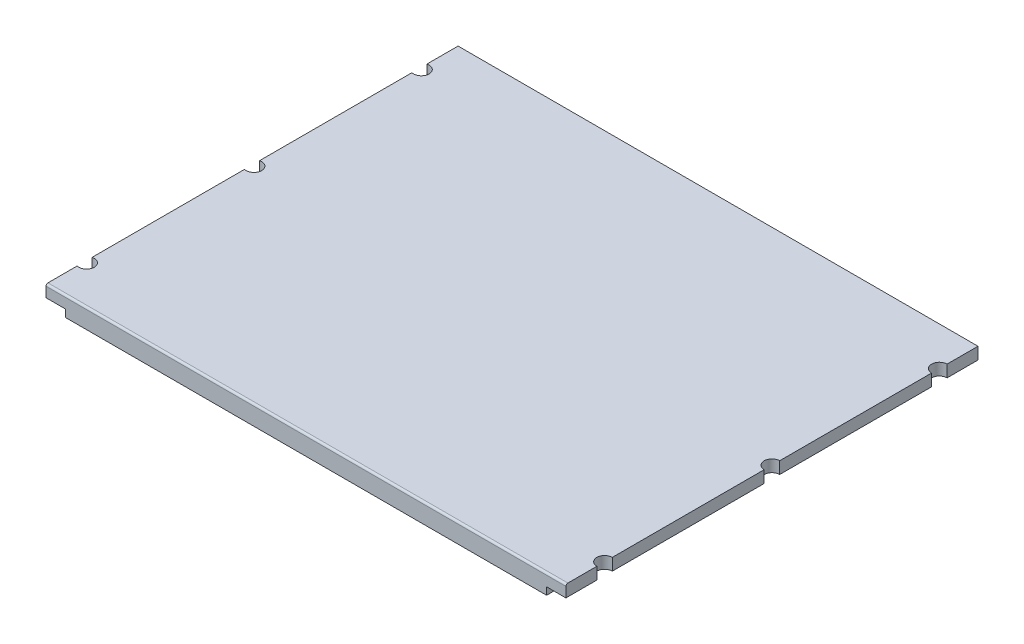
ISO-10303-21;
HEADER;
FILE_DESCRIPTION(('STEP AP214'),'2;1');
FILE_NAME('part.step','',(''),(''),'','','');
FILE_SCHEMA(('AUTOMOTIVE_DESIGN { 1 0 10303 214 1 1 1 1 }'));
ENDSEC;
DATA;
#1=APPLICATION_CONTEXT('core data for automotive mechanical design processes');
#2=APPLICATION_PROTOCOL_DEFINITION('international standard','automotive_design',2000,#1);
#3=PRODUCT_CONTEXT('',#1,'mechanical');
#4=PRODUCT('Part','Part','',(#3));
#5=PRODUCT_RELATED_PRODUCT_CATEGORY('part','',(#4));
#6=PRODUCT_DEFINITION_FORMATION('','',#4);
#7=PRODUCT_DEFINITION_CONTEXT('part definition',#1,'design');
#8=PRODUCT_DEFINITION('design','',#6,#7);
#9=PRODUCT_DEFINITION_SHAPE('','',#8);
#10=(LENGTH_UNIT() NAMED_UNIT(*) SI_UNIT(.MILLI.,.METRE.));
#11=(NAMED_UNIT(*) PLANE_ANGLE_UNIT() SI_UNIT($,.RADIAN.));
#12=(NAMED_UNIT(*) SI_UNIT($,.STERADIAN.) SOLID_ANGLE_UNIT());
#13=UNCERTAINTY_MEASURE_WITH_UNIT(LENGTH_MEASURE(1.E-05),#10,'distance_accuracy_value','');
#14=(GEOMETRIC_REPRESENTATION_CONTEXT(3) GLOBAL_UNCERTAINTY_ASSIGNED_CONTEXT((#13)) GLOBAL_UNIT_ASSIGNED_CONTEXT((#10,
#11,#12)) REPRESENTATION_CONTEXT('',''));
#15=CARTESIAN_POINT('',(0.,0.,0.));
#16=DIRECTION('',(0.,0.,1.));
#17=DIRECTION('',(1.,0.,0.));
#18=AXIS2_PLACEMENT_3D('',#15,#16,#17);
#19=CARTESIAN_POINT('',(35.,216.978424147796,2.99000000000001));
#20=DIRECTION('',(1.,0.,0.));
#21=DIRECTION('',(0.,0.,-1.));
#22=AXIS2_PLACEMENT_3D('',#19,#20,#21);
#23=PLANE('',#22);
#24=DIRECTION('',(0.,0.,1.));
#25=VECTOR('',#24,1.);
#26=CARTESIAN_POINT('',(35.,196.904550768447,2.99000000000001));
#27=LINE('',#26,#25);
#28=CARTESIAN_POINT('',(35.,196.904550768447,14.9364916731037));
#29=VERTEX_POINT('',#28);
#30=CARTESIAN_POINT('',(35.,196.904550768447,54.3635083268964));
#31=VERTEX_POINT('',#30);
#32=EDGE_CURVE('E245',#29,#31,#27,.T.);
#33=ORIENTED_EDGE('',*,*,#32,.T.);
#34=DIRECTION('',(0.,1.,0.));
#35=VECTOR('',#34,1.);
#36=CARTESIAN_POINT('',(35.,190.,54.3635083268964));
#37=LINE('',#36,#35);
#38=CARTESIAN_POINT('',(35.,200.,54.3635083268964));
#39=VERTEX_POINT('',#38);
#40=EDGE_CURVE('E272',#39,#31,#37,.F.);
#41=ORIENTED_EDGE('',*,*,#40,.F.);
#42=DIRECTION('',(0.,0.,1.));
#43=VECTOR('',#42,1.);
#44=CARTESIAN_POINT('',(35.,200.,109.6));
#45=LINE('',#44,#43);
#46=CARTESIAN_POINT('',(35.,200.,14.9364916731037));
#47=VERTEX_POINT('',#46);
#48=EDGE_CURVE('E293',#47,#39,#45,.T.);
#49=ORIENTED_EDGE('',*,*,#48,.F.);
#50=DIRECTION('',(0.,1.,0.));
#51=VECTOR('',#50,1.);
#52=CARTESIAN_POINT('',(35.,190.,14.9364916731037));
#53=LINE('',#52,#51);
#54=EDGE_CURVE('E288',#29,#47,#53,.T.);
#55=ORIENTED_EDGE('',*,*,#54,.F.);
#56=EDGE_LOOP('',(#33,#41,#49,#55));
#57=FACE_BOUND('',#56,.T.);
#58=ADVANCED_FACE('F33',(#57),#23,.F.);
#59=CARTESIAN_POINT('',(35.,200.,58.2364916731036));
#60=VERTEX_POINT('',#59);
#61=CARTESIAN_POINT('',(35.,200.,97.6635083268963));
#62=VERTEX_POINT('',#61);
#63=EDGE_CURVE('E365',#60,#62,#45,.T.);
#64=ORIENTED_EDGE('',*,*,#63,.F.);
#65=DIRECTION('',(0.,1.,0.));
#66=VECTOR('',#65,1.);
#67=CARTESIAN_POINT('',(35.,190.,58.2364916731036));
#68=LINE('',#67,#66);
#69=CARTESIAN_POINT('',(35.,196.904550768447,58.2364916731036));
#70=VERTEX_POINT('',#69);
#71=EDGE_CURVE('E264',#70,#60,#68,.T.);
#72=ORIENTED_EDGE('',*,*,#71,.F.);
#73=CARTESIAN_POINT('',(35.,196.904550768447,97.6635083268963));
#74=VERTEX_POINT('',#73);
#75=EDGE_CURVE('E251',#70,#74,#27,.T.);
#76=ORIENTED_EDGE('',*,*,#75,.T.);
#77=DIRECTION('',(0.,1.,0.));
#78=VECTOR('',#77,1.);
#79=CARTESIAN_POINT('',(35.,190.,97.6635083268963));
#80=LINE('',#79,#78);
#81=EDGE_CURVE('E262',#62,#74,#80,.F.);
#82=ORIENTED_EDGE('',*,*,#81,.F.);
#83=EDGE_LOOP('',(#64,#72,#76,#82));
#84=FACE_BOUND('',#83,.T.);
#85=ADVANCED_FACE('F261',(#84),#23,.F.);
#86=CARTESIAN_POINT('',(40.,196.904550768447,2.99000000000001));
#87=DIRECTION('',(0.,1.,0.));
#88=DIRECTION('',(0.,0.,1.));
#89=AXIS2_PLACEMENT_3D('',#86,#87,#88);
#90=PLANE('',#89);
#91=DIRECTION('',(0.,0.,1.));
#92=VECTOR('',#91,1.);
#93=CARTESIAN_POINT('',(40.,196.904550768447,2.99000000000001));
#94=LINE('',#93,#92);
#95=CARTESIAN_POINT('',(40.,196.904550768447,3.));
#96=VERTEX_POINT('',#95);
#97=CARTESIAN_POINT('',(40.,196.904550768447,109.6));
#98=VERTEX_POINT('',#97);
#99=EDGE_CURVE('E208',#96,#98,#94,.T.);
#100=ORIENTED_EDGE('',*,*,#99,.T.);
#101=DIRECTION('',(1.,0.,0.));
#102=VECTOR('',#101,1.);
#103=CARTESIAN_POINT('',(0.,196.904550768447,109.6));
#104=LINE('',#103,#102);
#105=CARTESIAN_POINT('',(35.,196.904550768447,109.6));
#106=VERTEX_POINT('',#105);
#107=EDGE_CURVE('E298',#106,#98,#104,.T.);
#108=ORIENTED_EDGE('',*,*,#107,.F.);
#109=CARTESIAN_POINT('',(35.,196.904550768447,101.536491673104));
#110=VERTEX_POINT('',#109);
#111=EDGE_CURVE('E37',#110,#106,#27,.T.);
#112=ORIENTED_EDGE('',*,*,#111,.F.);
#113=CARTESIAN_POINT('',(35.5000000000003,196.904550768447,99.6));
#114=DIRECTION('',(0.,1.,0.));
#115=DIRECTION('',(0.,0.,1.));
#116=AXIS2_PLACEMENT_3D('',#113,#114,#115);
#117=CIRCLE('',#116,2.);
#118=EDGE_CURVE('E267',#74,#110,#117,.F.);
#119=ORIENTED_EDGE('',*,*,#118,.F.);
#120=ORIENTED_EDGE('',*,*,#75,.F.);
#121=CARTESIAN_POINT('',(35.5000000000004,196.904550768447,56.3));
#122=DIRECTION('',(0.,1.,0.));
#123=DIRECTION('',(0.,0.,1.));
#124=AXIS2_PLACEMENT_3D('',#121,#122,#123);
#125=CIRCLE('',#124,2.);
#126=EDGE_CURVE('E304',#31,#70,#125,.F.);
#127=ORIENTED_EDGE('',*,*,#126,.F.);
#128=ORIENTED_EDGE('',*,*,#32,.F.);
#129=CARTESIAN_POINT('',(35.5,196.904550768447,13.));
#130=DIRECTION('',(0.,1.,0.));
#131=DIRECTION('',(0.,0.,1.));
#132=AXIS2_PLACEMENT_3D('',#129,#130,#131);
#133=CIRCLE('',#132,2.);
#134=CARTESIAN_POINT('',(35.,196.904550768447,11.0635083268963));
#135=VERTEX_POINT('',#134);
#136=EDGE_CURVE('E278',#135,#29,#133,.F.);
#137=ORIENTED_EDGE('',*,*,#136,.F.);
#138=CARTESIAN_POINT('',(35.,196.904550768447,3.));
#139=VERTEX_POINT('',#138);
#140=EDGE_CURVE('E240',#139,#135,#27,.T.);
#141=ORIENTED_EDGE('',*,*,#140,.F.);
#142=DIRECTION('',(-1.,0.,0.));
#143=VECTOR('',#142,1.);
#144=CARTESIAN_POINT('',(-0.01000000000001,196.904550768447,3.));
#145=LINE('',#144,#143);
#146=EDGE_CURVE('E283',#96,#139,#145,.T.);
#147=ORIENTED_EDGE('',*,*,#146,.F.);
#148=EDGE_LOOP('',(#100,#108,#112,#119,#120,#127,#128,#137,#141,#147));
#149=FACE_BOUND('',#148,.T.);
#150=ADVANCED_FACE('F268',(#149),#90,.F.);
#151=CARTESIAN_POINT('',(40.,195.,2.99000000000001));
#152=DIRECTION('',(1.,0.,0.));
#153=DIRECTION('',(0.,0.,-1.));
#154=AXIS2_PLACEMENT_3D('',#151,#152,#153);
#155=PLANE('',#154);
#156=DIRECTION('',(0.,0.,1.));
#157=VECTOR('',#156,1.);
#158=CARTESIAN_POINT('',(40.,195.,109.6));
#159=LINE('',#158,#157);
#160=CARTESIAN_POINT('',(40.,195.,3.));
#161=VERTEX_POINT('',#160);
#162=CARTESIAN_POINT('',(40.,195.,109.6));
#163=VERTEX_POINT('',#162);
#164=EDGE_CURVE('E233',#161,#163,#159,.T.);
#165=ORIENTED_EDGE('',*,*,#164,.T.);
#166=DIRECTION('',(0.,-1.,0.));
#167=VECTOR('',#166,1.);
#168=CARTESIAN_POINT('',(40.,0.,109.6));
#169=LINE('',#168,#167);
#170=EDGE_CURVE('E296',#98,#163,#169,.T.);
#171=ORIENTED_EDGE('',*,*,#170,.F.);
#172=ORIENTED_EDGE('',*,*,#99,.F.);
#173=DIRECTION('',(0.,1.,0.));
#174=VECTOR('',#173,1.);
#175=CARTESIAN_POINT('',(40.,0.,3.));
#176=LINE('',#175,#174);
#177=EDGE_CURVE('E330',#161,#96,#176,.T.);
#178=ORIENTED_EDGE('',*,*,#177,.F.);
#179=EDGE_LOOP('',(#165,#171,#172,#178));
#180=FACE_BOUND('',#179,.T.);
#181=ADVANCED_FACE('F396',(#180),#155,.F.);
#182=ORIENTED_EDGE('',*,*,#140,.T.);
#183=DIRECTION('',(0.,1.,0.));
#184=VECTOR('',#183,1.);
#185=CARTESIAN_POINT('',(35.,190.,11.0635083268963));
#186=LINE('',#185,#184);
#187=CARTESIAN_POINT('',(35.,200.,11.0635083268963));
#188=VERTEX_POINT('',#187);
#189=EDGE_CURVE('E284',#188,#135,#186,.F.);
#190=ORIENTED_EDGE('',*,*,#189,.F.);
#191=CARTESIAN_POINT('',(35.,200.,3.));
#192=VERTEX_POINT('',#191);
#193=EDGE_CURVE('E291',#192,#188,#45,.T.);
#194=ORIENTED_EDGE('',*,*,#193,.F.);
#195=DIRECTION('',(0.,1.,0.));
#196=VECTOR('',#195,1.);
#197=CARTESIAN_POINT('',(35.,0.,3.));
#198=LINE('',#197,#196);
#199=EDGE_CURVE('E280',#139,#192,#198,.T.);
#200=ORIENTED_EDGE('',*,*,#199,.F.);
#201=EDGE_LOOP('',(#182,#190,#194,#200));
#202=FACE_BOUND('',#201,.T.);
#203=ADVANCED_FACE('F355',(#202),#23,.F.);
#204=CARTESIAN_POINT('',(35.,199.5,109.1));
#205=DIRECTION('',(1.,0.,0.));
#206=DIRECTION('',(0.,0.,-1.));
#207=AXIS2_PLACEMENT_3D('',#204,#205,#206);
#208=CIRCLE('',#207,0.5);
#209=CARTESIAN_POINT('',(35.,199.5,109.6));
#210=VERTEX_POINT('',#209);
#211=CARTESIAN_POINT('',(35.,200.,109.1));
#212=VERTEX_POINT('',#211);
#213=EDGE_CURVE('E199',#210,#212,#208,.F.);
#214=ORIENTED_EDGE('',*,*,#213,.T.);
#215=CARTESIAN_POINT('',(35.,200.,101.536491673104));
#216=VERTEX_POINT('',#215);
#217=EDGE_CURVE('E295',#216,#212,#45,.T.);
#218=ORIENTED_EDGE('',*,*,#217,.F.);
#219=DIRECTION('',(0.,1.,0.));
#220=VECTOR('',#219,1.);
#221=CARTESIAN_POINT('',(35.,190.,101.536491673104));
#222=LINE('',#221,#220);
#223=EDGE_CURVE('E270',#110,#216,#222,.T.);
#224=ORIENTED_EDGE('',*,*,#223,.F.);
#225=ORIENTED_EDGE('',*,*,#111,.T.);
#226=DIRECTION('',(0.,-1.,0.));
#227=VECTOR('',#226,1.);
#228=CARTESIAN_POINT('',(35.,0.,109.6));
#229=LINE('',#228,#227);
#230=EDGE_CURVE('E286',#210,#106,#229,.T.);
#231=ORIENTED_EDGE('',*,*,#230,.F.);
#232=EDGE_LOOP('',(#214,#218,#224,#225,#231));
#233=FACE_BOUND('',#232,.T.);
#234=ADVANCED_FACE('F370',(#233),#23,.F.);
#235=CARTESIAN_POINT('',(169.5,196.904550768447,2.99000000000001));
#236=DIRECTION('',(0.,1.,0.));
#237=DIRECTION('',(0.,0.,1.));
#238=AXIS2_PLACEMENT_3D('',#235,#236,#237);
#239=PLANE('',#238);
#240=DIRECTION('',(0.,0.,1.));
#241=VECTOR('',#240,1.);
#242=CARTESIAN_POINT('',(169.5,196.904550768447,2.99000000000001));
#243=LINE('',#242,#241);
#244=CARTESIAN_POINT('',(169.5,196.904550768447,3.));
#245=VERTEX_POINT('',#244);
#246=CARTESIAN_POINT('',(169.5,196.904550768447,11.));
#247=VERTEX_POINT('',#246);
#248=EDGE_CURVE('E186',#245,#247,#243,.T.);
#249=ORIENTED_EDGE('',*,*,#248,.T.);
#250=CARTESIAN_POINT('',(169.5,196.904550768447,13.));
#251=DIRECTION('',(0.,1.,0.));
#252=DIRECTION('',(0.,0.,1.));
#253=AXIS2_PLACEMENT_3D('',#250,#251,#252);
#254=CIRCLE('',#253,2.);
#255=CARTESIAN_POINT('',(169.5,196.904550768447,15.));
#256=VERTEX_POINT('',#255);
#257=EDGE_CURVE('E180',#256,#247,#254,.F.);
#258=ORIENTED_EDGE('',*,*,#257,.F.);
#259=CARTESIAN_POINT('',(169.5,196.904550768447,54.3));
#260=VERTEX_POINT('',#259);
#261=EDGE_CURVE('E184',#256,#260,#243,.T.);
#262=ORIENTED_EDGE('',*,*,#261,.T.);
#263=CARTESIAN_POINT('',(169.5,196.904550768447,56.3));
#264=DIRECTION('',(0.,1.,0.));
#265=DIRECTION('',(0.,0.,1.));
#266=AXIS2_PLACEMENT_3D('',#263,#264,#265);
#267=CIRCLE('',#266,1.99999999999997);
#268=CARTESIAN_POINT('',(169.5,196.904550768447,58.3));
#269=VERTEX_POINT('',#268);
#270=EDGE_CURVE('E274',#269,#260,#267,.F.);
#271=ORIENTED_EDGE('',*,*,#270,.F.);
#272=CARTESIAN_POINT('',(169.5,196.904550768447,97.6));
#273=VERTEX_POINT('',#272);
#274=EDGE_CURVE('E197',#269,#273,#243,.T.);
#275=ORIENTED_EDGE('',*,*,#274,.T.);
#276=CARTESIAN_POINT('',(169.5,196.904550768447,99.6));
#277=DIRECTION('',(0.,1.,0.));
#278=DIRECTION('',(0.,0.,1.));
#279=AXIS2_PLACEMENT_3D('',#276,#277,#278);
#280=CIRCLE('',#279,2.);
#281=CARTESIAN_POINT('',(169.5,196.904550768447,101.6));
#282=VERTEX_POINT('',#281);
#283=EDGE_CURVE('E192',#282,#273,#280,.F.);
#284=ORIENTED_EDGE('',*,*,#283,.F.);
#285=CARTESIAN_POINT('',(169.5,196.904550768447,109.6));
#286=VERTEX_POINT('',#285);
#287=EDGE_CURVE('E200',#282,#286,#243,.T.);
#288=ORIENTED_EDGE('',*,*,#287,.T.);
#289=DIRECTION('',(1.,0.,0.));
#290=VECTOR('',#289,1.);
#291=CARTESIAN_POINT('',(0.,196.904550768447,109.6));
#292=LINE('',#291,#290);
#293=CARTESIAN_POINT('',(164.5,196.904550768447,109.6));
#294=VERTEX_POINT('',#293);
#295=EDGE_CURVE('E320',#294,#286,#292,.T.);
#296=ORIENTED_EDGE('',*,*,#295,.F.);
#297=DIRECTION('',(0.,0.,1.));
#298=VECTOR('',#297,1.);
#299=CARTESIAN_POINT('',(164.5,196.904550768447,2.99000000000001));
#300=LINE('',#299,#298);
#301=CARTESIAN_POINT('',(164.5,196.904550768447,3.));
#302=VERTEX_POINT('',#301);
#303=EDGE_CURVE('E204',#302,#294,#300,.T.);
#304=ORIENTED_EDGE('',*,*,#303,.F.);
#305=DIRECTION('',(-1.,0.,0.));
#306=VECTOR('',#305,1.);
#307=CARTESIAN_POINT('',(-0.01000000000001,196.904550768447,3.));
#308=LINE('',#307,#306);
#309=EDGE_CURVE('E331',#245,#302,#308,.T.);
#310=ORIENTED_EDGE('',*,*,#309,.F.);
#311=EDGE_LOOP('',(#249,#258,#262,#271,#275,#284,#288,#296,#304,#310));
#312=FACE_BOUND('',#311,.T.);
#313=ADVANCED_FACE('F182',(#312),#239,.F.);
#314=CARTESIAN_POINT('',(169.5,212.925759261579,2.99000000000001));
#315=DIRECTION('',(-1.,0.,0.));
#316=DIRECTION('',(0.,0.,1.));
#317=AXIS2_PLACEMENT_3D('',#314,#315,#316);
#318=PLANE('',#317);
#319=DIRECTION('',(0.,0.,-1.));
#320=VECTOR('',#319,1.);
#321=CARTESIAN_POINT('',(169.5,200.,109.6));
#322=LINE('',#321,#320);
#323=CARTESIAN_POINT('',(169.5,200.,11.));
#324=VERTEX_POINT('',#323);
#325=CARTESIAN_POINT('',(169.5,200.,3.));
#326=VERTEX_POINT('',#325);
#327=EDGE_CURVE('E294',#324,#326,#322,.T.);
#328=ORIENTED_EDGE('',*,*,#327,.F.);
#329=DIRECTION('',(0.,1.,0.));
#330=VECTOR('',#329,1.);
#331=CARTESIAN_POINT('',(169.5,190.,11.));
#332=LINE('',#331,#330);
#333=EDGE_CURVE('E49',#247,#324,#332,.T.);
#334=ORIENTED_EDGE('',*,*,#333,.F.);
#335=ORIENTED_EDGE('',*,*,#248,.F.);
#336=DIRECTION('',(0.,-1.,0.));
#337=VECTOR('',#336,1.);
#338=CARTESIAN_POINT('',(169.5,0.,3.));
#339=LINE('',#338,#337);
#340=EDGE_CURVE('E236',#326,#245,#339,.T.);
#341=ORIENTED_EDGE('',*,*,#340,.F.);
#342=EDGE_LOOP('',(#328,#334,#335,#341));
#343=FACE_BOUND('',#342,.T.);
#344=ADVANCED_FACE('F423',(#343),#318,.F.);
#345=CARTESIAN_POINT('',(164.5,195.,2.99000000000001));
#346=DIRECTION('',(-1.,0.,0.));
#347=DIRECTION('',(0.,0.,1.));
#348=AXIS2_PLACEMENT_3D('',#345,#346,#347);
#349=PLANE('',#348);
#350=ORIENTED_EDGE('',*,*,#303,.T.);
#351=DIRECTION('',(0.,1.,0.));
#352=VECTOR('',#351,1.);
#353=CARTESIAN_POINT('',(164.5,0.,109.6));
#354=LINE('',#353,#352);
#355=CARTESIAN_POINT('',(164.5,195.,109.6));
#356=VERTEX_POINT('',#355);
#357=EDGE_CURVE('E299',#356,#294,#354,.T.);
#358=ORIENTED_EDGE('',*,*,#357,.F.);
#359=DIRECTION('',(0.,0.,1.));
#360=VECTOR('',#359,1.);
#361=CARTESIAN_POINT('',(164.5,195.,2.99000000000001));
#362=LINE('',#361,#360);
#363=CARTESIAN_POINT('',(164.5,195.,3.));
#364=VERTEX_POINT('',#363);
#365=EDGE_CURVE('E282',#364,#356,#362,.T.);
#366=ORIENTED_EDGE('',*,*,#365,.F.);
#367=DIRECTION('',(0.,-1.,0.));
#368=VECTOR('',#367,1.);
#369=CARTESIAN_POINT('',(164.5,0.,3.));
#370=LINE('',#369,#368);
#371=EDGE_CURVE('E328',#302,#364,#370,.T.);
#372=ORIENTED_EDGE('',*,*,#371,.F.);
#373=EDGE_LOOP('',(#350,#358,#366,#372));
#374=FACE_BOUND('',#373,.T.);
#375=ADVANCED_FACE('F390',(#374),#349,.F.);
#376=CARTESIAN_POINT('',(169.5,199.5,109.1));
#377=DIRECTION('',(-1.,0.,0.));
#378=DIRECTION('',(0.,0.,1.));
#379=AXIS2_PLACEMENT_3D('',#376,#377,#378);
#380=CIRCLE('',#379,0.5);
#381=CARTESIAN_POINT('',(169.5,200.,109.1));
#382=VERTEX_POINT('',#381);
#383=CARTESIAN_POINT('',(169.5,199.5,109.6));
#384=VERTEX_POINT('',#383);
#385=EDGE_CURVE('E237',#382,#384,#380,.F.);
#386=ORIENTED_EDGE('',*,*,#385,.T.);
#387=DIRECTION('',(0.,1.,0.));
#388=VECTOR('',#387,1.);
#389=CARTESIAN_POINT('',(169.5,0.,109.6));
#390=LINE('',#389,#388);
#391=EDGE_CURVE('E322',#286,#384,#390,.T.);
#392=ORIENTED_EDGE('',*,*,#391,.F.);
#393=ORIENTED_EDGE('',*,*,#287,.F.);
#394=DIRECTION('',(0.,1.,0.));
#395=VECTOR('',#394,1.);
#396=CARTESIAN_POINT('',(169.5,190.,101.6));
#397=LINE('',#396,#395);
#398=CARTESIAN_POINT('',(169.5,200.,101.6));
#399=VERTEX_POINT('',#398);
#400=EDGE_CURVE('E306',#399,#282,#397,.F.);
#401=ORIENTED_EDGE('',*,*,#400,.F.);
#402=EDGE_CURVE('E324',#382,#399,#322,.T.);
#403=ORIENTED_EDGE('',*,*,#402,.F.);
#404=EDGE_LOOP('',(#386,#392,#393,#401,#403));
#405=FACE_BOUND('',#404,.T.);
#406=ADVANCED_FACE('F377',(#405),#318,.F.);
#407=CARTESIAN_POINT('',(169.5,200.,97.6));
#408=VERTEX_POINT('',#407);
#409=CARTESIAN_POINT('',(169.5,200.,58.3));
#410=VERTEX_POINT('',#409);
#411=EDGE_CURVE('E326',#408,#410,#322,.T.);
#412=ORIENTED_EDGE('',*,*,#411,.F.);
#413=DIRECTION('',(0.,1.,0.));
#414=VECTOR('',#413,1.);
#415=CARTESIAN_POINT('',(169.5,190.,97.6));
#416=LINE('',#415,#414);
#417=EDGE_CURVE('E310',#273,#408,#416,.T.);
#418=ORIENTED_EDGE('',*,*,#417,.F.);
#419=ORIENTED_EDGE('',*,*,#274,.F.);
#420=DIRECTION('',(0.,1.,0.));
#421=VECTOR('',#420,1.);
#422=CARTESIAN_POINT('',(169.5,190.,58.3));
#423=LINE('',#422,#421);
#424=EDGE_CURVE('E289',#410,#269,#423,.F.);
#425=ORIENTED_EDGE('',*,*,#424,.F.);
#426=EDGE_LOOP('',(#412,#418,#419,#425));
#427=FACE_BOUND('',#426,.T.);
#428=ADVANCED_FACE('F382',(#427),#318,.F.);
#429=ORIENTED_EDGE('',*,*,#261,.F.);
#430=DIRECTION('',(0.,1.,0.));
#431=VECTOR('',#430,1.);
#432=CARTESIAN_POINT('',(169.5,190.,15.));
#433=LINE('',#432,#431);
#434=CARTESIAN_POINT('',(169.5,200.,15.));
#435=VERTEX_POINT('',#434);
#436=EDGE_CURVE('E189',#435,#256,#433,.F.);
#437=ORIENTED_EDGE('',*,*,#436,.F.);
#438=CARTESIAN_POINT('',(169.5,200.,54.3));
#439=VERTEX_POINT('',#438);
#440=EDGE_CURVE('E57',#439,#435,#322,.T.);
#441=ORIENTED_EDGE('',*,*,#440,.F.);
#442=DIRECTION('',(0.,1.,0.));
#443=VECTOR('',#442,1.);
#444=CARTESIAN_POINT('',(169.5,190.,54.3));
#445=LINE('',#444,#443);
#446=EDGE_CURVE('E196',#260,#439,#445,.T.);
#447=ORIENTED_EDGE('',*,*,#446,.F.);
#448=EDGE_LOOP('',(#429,#437,#441,#447));
#449=FACE_BOUND('',#448,.T.);
#450=ADVANCED_FACE('F195',(#449),#318,.F.);
#451=CARTESIAN_POINT('',(-0.01000000000001,0.,3.));
#452=DIRECTION('',(0.,0.,1.));
#453=DIRECTION('',(1.,0.,0.));
#454=AXIS2_PLACEMENT_3D('',#451,#452,#453);
#455=PLANE('',#454);
#456=DIRECTION('',(-1.,0.,0.));
#457=VECTOR('',#456,1.);
#458=CARTESIAN_POINT('',(0.,200.,3.));
#459=LINE('',#458,#457);
#460=EDGE_CURVE('E228',#326,#192,#459,.T.);
#461=ORIENTED_EDGE('',*,*,#460,.F.);
#462=ORIENTED_EDGE('',*,*,#340,.T.);
#463=ORIENTED_EDGE('',*,*,#309,.T.);
#464=ORIENTED_EDGE('',*,*,#371,.T.);
#465=DIRECTION('',(-1.,0.,0.));
#466=VECTOR('',#465,1.);
#467=CARTESIAN_POINT('',(197.,195.,3.));
#468=LINE('',#467,#466);
#469=EDGE_CURVE('E187',#364,#161,#468,.T.);
#470=ORIENTED_EDGE('',*,*,#469,.T.);
#471=ORIENTED_EDGE('',*,*,#177,.T.);
#472=ORIENTED_EDGE('',*,*,#146,.T.);
#473=ORIENTED_EDGE('',*,*,#199,.T.);
#474=EDGE_LOOP('',(#461,#462,#463,#464,#470,#471,#472,#473));
#475=FACE_BOUND('',#474,.T.);
#476=ADVANCED_FACE('F352',(#475),#455,.F.);
#477=CARTESIAN_POINT('',(0.,195.,109.6));
#478=DIRECTION('',(0.,-1.,0.));
#479=DIRECTION('',(0.,0.,-1.));
#480=AXIS2_PLACEMENT_3D('',#477,#478,#479);
#481=PLANE('',#480);
#482=ORIENTED_EDGE('',*,*,#469,.F.);
#483=ORIENTED_EDGE('',*,*,#365,.T.);
#484=DIRECTION('',(-1.,0.,0.));
#485=VECTOR('',#484,1.);
#486=CARTESIAN_POINT('',(0.,195.,109.6));
#487=LINE('',#486,#485);
#488=EDGE_CURVE('E219',#356,#163,#487,.T.);
#489=ORIENTED_EDGE('',*,*,#488,.T.);
#490=ORIENTED_EDGE('',*,*,#164,.F.);
#491=EDGE_LOOP('',(#482,#483,#489,#490));
#492=FACE_BOUND('',#491,.T.);
#493=ADVANCED_FACE('F394',(#492),#481,.T.);
#494=CARTESIAN_POINT('',(0.,0.,109.6));
#495=DIRECTION('',(0.,0.,-1.));
#496=DIRECTION('',(-1.,0.,0.));
#497=AXIS2_PLACEMENT_3D('',#494,#495,#496);
#498=PLANE('',#497);
#499=ORIENTED_EDGE('',*,*,#295,.T.);
#500=ORIENTED_EDGE('',*,*,#391,.T.);
#501=DIRECTION('',(-1.,0.,0.));
#502=VECTOR('',#501,1.);
#503=CARTESIAN_POINT('',(0.,199.5,109.6));
#504=LINE('',#503,#502);
#505=EDGE_CURVE('E222',#384,#210,#504,.T.);
#506=ORIENTED_EDGE('',*,*,#505,.T.);
#507=ORIENTED_EDGE('',*,*,#230,.T.);
#508=ORIENTED_EDGE('',*,*,#107,.T.);
#509=ORIENTED_EDGE('',*,*,#170,.T.);
#510=ORIENTED_EDGE('',*,*,#488,.F.);
#511=ORIENTED_EDGE('',*,*,#357,.T.);
#512=EDGE_LOOP('',(#499,#500,#506,#507,#508,#509,#510,#511));
#513=FACE_BOUND('',#512,.T.);
#514=ADVANCED_FACE('F35',(#513),#498,.F.);
#515=CARTESIAN_POINT('',(0.,200.,109.6));
#516=DIRECTION('',(0.,-1.,0.));
#517=DIRECTION('',(0.,0.,-1.));
#518=AXIS2_PLACEMENT_3D('',#515,#516,#517);
#519=PLANE('',#518);
#520=DIRECTION('',(-1.,0.,0.));
#521=VECTOR('',#520,1.);
#522=CARTESIAN_POINT('',(0.,200.,109.1));
#523=LINE('',#522,#521);
#524=EDGE_CURVE('E225',#212,#382,#523,.F.);
#525=ORIENTED_EDGE('',*,*,#524,.T.);
#526=ORIENTED_EDGE('',*,*,#402,.T.);
#527=CARTESIAN_POINT('',(169.5,200.,99.6));
#528=DIRECTION('',(0.,1.,0.));
#529=DIRECTION('',(0.,0.,-1.));
#530=AXIS2_PLACEMENT_3D('',#527,#528,#529);
#531=CIRCLE('',#530,2.);
#532=EDGE_CURVE('E215',#408,#399,#531,.T.);
#533=ORIENTED_EDGE('',*,*,#532,.F.);
#534=ORIENTED_EDGE('',*,*,#411,.T.);
#535=CARTESIAN_POINT('',(169.5,200.,56.3));
#536=DIRECTION('',(0.,1.,0.));
#537=DIRECTION('',(0.,0.,-1.));
#538=AXIS2_PLACEMENT_3D('',#535,#536,#537);
#539=CIRCLE('',#538,1.99999999999997);
#540=EDGE_CURVE('E42',#439,#410,#539,.T.);
#541=ORIENTED_EDGE('',*,*,#540,.F.);
#542=ORIENTED_EDGE('',*,*,#440,.T.);
#543=CARTESIAN_POINT('',(169.5,200.,13.));
#544=DIRECTION('',(0.,1.,0.));
#545=DIRECTION('',(0.,0.,-1.));
#546=AXIS2_PLACEMENT_3D('',#543,#544,#545);
#547=CIRCLE('',#546,2.);
#548=EDGE_CURVE('E11',#324,#435,#547,.T.);
#549=ORIENTED_EDGE('',*,*,#548,.F.);
#550=ORIENTED_EDGE('',*,*,#327,.T.);
#551=ORIENTED_EDGE('',*,*,#460,.T.);
#552=ORIENTED_EDGE('',*,*,#193,.T.);
#553=CARTESIAN_POINT('',(35.5,200.,13.));
#554=DIRECTION('',(0.,1.,0.));
#555=DIRECTION('',(0.,0.,1.));
#556=AXIS2_PLACEMENT_3D('',#553,#554,#555);
#557=CIRCLE('',#556,2.);
#558=EDGE_CURVE('E216',#47,#188,#557,.T.);
#559=ORIENTED_EDGE('',*,*,#558,.F.);
#560=ORIENTED_EDGE('',*,*,#48,.T.);
#561=CARTESIAN_POINT('',(35.5000000000004,200.,56.3));
#562=DIRECTION('',(0.,1.,0.));
#563=DIRECTION('',(0.,0.,1.));
#564=AXIS2_PLACEMENT_3D('',#561,#562,#563);
#565=CIRCLE('',#564,2.);
#566=EDGE_CURVE('E212',#60,#39,#565,.T.);
#567=ORIENTED_EDGE('',*,*,#566,.F.);
#568=ORIENTED_EDGE('',*,*,#63,.T.);
#569=CARTESIAN_POINT('',(35.5000000000003,200.,99.6));
#570=DIRECTION('',(0.,1.,0.));
#571=DIRECTION('',(0.,0.,1.));
#572=AXIS2_PLACEMENT_3D('',#569,#570,#571);
#573=CIRCLE('',#572,2.);
#574=EDGE_CURVE('E209',#216,#62,#573,.T.);
#575=ORIENTED_EDGE('',*,*,#574,.F.);
#576=ORIENTED_EDGE('',*,*,#217,.T.);
#577=EDGE_LOOP('',(#525,#526,#533,#534,#541,#542,#549,#550,#551,#552,#559,#560,#567,#568,#575,#576));
#578=FACE_BOUND('',#577,.T.);
#579=ADVANCED_FACE('F343',(#578),#519,.F.);
#580=CARTESIAN_POINT('',(169.5,190.,13.));
#581=DIRECTION('',(0.,1.,0.));
#582=DIRECTION('',(0.,0.,1.));
#583=AXIS2_PLACEMENT_3D('',#580,#581,#582);
#584=CYLINDRICAL_SURFACE('',#583,2.);
#585=ORIENTED_EDGE('',*,*,#548,.T.);
#586=ORIENTED_EDGE('',*,*,#436,.T.);
#587=ORIENTED_EDGE('',*,*,#257,.T.);
#588=ORIENTED_EDGE('',*,*,#333,.T.);
#589=EDGE_LOOP('',(#585,#586,#587,#588));
#590=FACE_BOUND('',#589,.T.);
#591=ADVANCED_FACE('F190',(#590),#584,.F.);
#592=CARTESIAN_POINT('',(169.5,190.,99.6));
#593=DIRECTION('',(0.,1.,0.));
#594=DIRECTION('',(0.,0.,1.));
#595=AXIS2_PLACEMENT_3D('',#592,#593,#594);
#596=CYLINDRICAL_SURFACE('',#595,2.);
#597=ORIENTED_EDGE('',*,*,#532,.T.);
#598=ORIENTED_EDGE('',*,*,#400,.T.);
#599=ORIENTED_EDGE('',*,*,#283,.T.);
#600=ORIENTED_EDGE('',*,*,#417,.T.);
#601=EDGE_LOOP('',(#597,#598,#599,#600));
#602=FACE_BOUND('',#601,.T.);
#603=ADVANCED_FACE('F381',(#602),#596,.F.);
#604=CARTESIAN_POINT('',(35.5000000000004,190.,56.3));
#605=DIRECTION('',(0.,1.,0.));
#606=DIRECTION('',(0.,0.,1.));
#607=AXIS2_PLACEMENT_3D('',#604,#605,#606);
#608=CYLINDRICAL_SURFACE('',#607,2.);
#609=ORIENTED_EDGE('',*,*,#566,.T.);
#610=ORIENTED_EDGE('',*,*,#40,.T.);
#611=ORIENTED_EDGE('',*,*,#126,.T.);
#612=ORIENTED_EDGE('',*,*,#71,.T.);
#613=EDGE_LOOP('',(#609,#610,#611,#612));
#614=FACE_BOUND('',#613,.T.);
#615=ADVANCED_FACE('F414',(#614),#608,.F.);
#616=CARTESIAN_POINT('',(35.5000000000003,190.,99.6));
#617=DIRECTION('',(0.,1.,0.));
#618=DIRECTION('',(0.,0.,1.));
#619=AXIS2_PLACEMENT_3D('',#616,#617,#618);
#620=CYLINDRICAL_SURFACE('',#619,2.);
#621=ORIENTED_EDGE('',*,*,#574,.T.);
#622=ORIENTED_EDGE('',*,*,#81,.T.);
#623=ORIENTED_EDGE('',*,*,#118,.T.);
#624=ORIENTED_EDGE('',*,*,#223,.T.);
#625=EDGE_LOOP('',(#621,#622,#623,#624));
#626=FACE_BOUND('',#625,.T.);
#627=ADVANCED_FACE('F417',(#626),#620,.F.);
#628=CARTESIAN_POINT('',(169.5,190.,56.3));
#629=DIRECTION('',(0.,1.,0.));
#630=DIRECTION('',(0.,0.,1.));
#631=AXIS2_PLACEMENT_3D('',#628,#629,#630);
#632=CYLINDRICAL_SURFACE('',#631,1.99999999999997);
#633=ORIENTED_EDGE('',*,*,#540,.T.);
#634=ORIENTED_EDGE('',*,*,#424,.T.);
#635=ORIENTED_EDGE('',*,*,#270,.T.);
#636=ORIENTED_EDGE('',*,*,#446,.T.);
#637=EDGE_LOOP('',(#633,#634,#635,#636));
#638=FACE_BOUND('',#637,.T.);
#639=ADVANCED_FACE('F340',(#638),#632,.F.);
#640=CARTESIAN_POINT('',(35.5,190.,13.));
#641=DIRECTION('',(0.,1.,0.));
#642=DIRECTION('',(0.,0.,1.));
#643=AXIS2_PLACEMENT_3D('',#640,#641,#642);
#644=CYLINDRICAL_SURFACE('',#643,2.);
#645=ORIENTED_EDGE('',*,*,#558,.T.);
#646=ORIENTED_EDGE('',*,*,#189,.T.);
#647=ORIENTED_EDGE('',*,*,#136,.T.);
#648=ORIENTED_EDGE('',*,*,#54,.T.);
#649=EDGE_LOOP('',(#645,#646,#647,#648));
#650=FACE_BOUND('',#649,.T.);
#651=ADVANCED_FACE('F361',(#650),#644,.F.);
#652=CARTESIAN_POINT('',(0.,199.5,109.1));
#653=DIRECTION('',(-1.,0.,0.));
#654=DIRECTION('',(0.,0.,1.));
#655=AXIS2_PLACEMENT_3D('',#652,#653,#654);
#656=CYLINDRICAL_SURFACE('',#655,0.5);
#657=ORIENTED_EDGE('',*,*,#385,.F.);
#658=ORIENTED_EDGE('',*,*,#524,.F.);
#659=ORIENTED_EDGE('',*,*,#213,.F.);
#660=ORIENTED_EDGE('',*,*,#505,.F.);
#661=EDGE_LOOP('',(#657,#658,#659,#660));
#662=FACE_BOUND('',#661,.T.);
#663=ADVANCED_FACE('F374',(#662),#656,.T.);
#664=CLOSED_SHELL('',(#58,#85,#150,#181,#203,#234,#313,#344,#375,#406,#428,#450,#476,#493,#514,
#579,#591,#603,#615,#627,#639,#651,#663));
#665=MANIFOLD_SOLID_BREP('B2',#664);
#666=ADVANCED_BREP_SHAPE_REPRESENTATION('',(#18,#665),#14);
#667=SHAPE_DEFINITION_REPRESENTATION(#9,#666);
ENDSEC;
END-ISO-10303-21;
